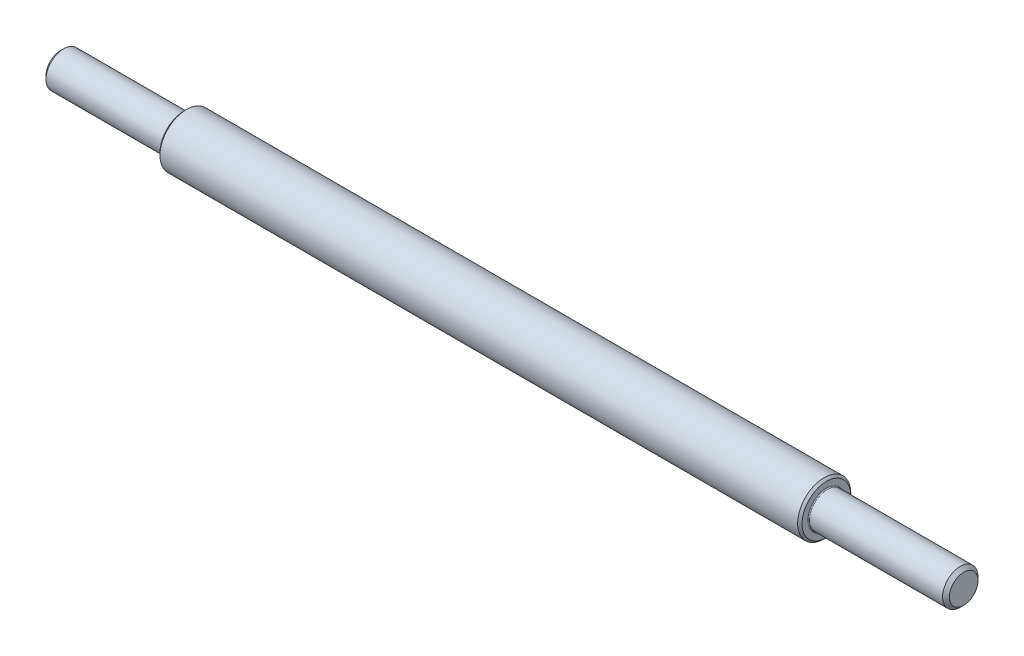
ISO-10303-21;
HEADER;
FILE_DESCRIPTION(('STEP AP214'),'2;1');
FILE_NAME('part.step','',(''),(''),'','','');
FILE_SCHEMA(('AUTOMOTIVE_DESIGN { 1 0 10303 214 1 1 1 1 }'));
ENDSEC;
DATA;
#1=APPLICATION_CONTEXT('core data for automotive mechanical design processes');
#2=APPLICATION_PROTOCOL_DEFINITION('international standard','automotive_design',2000,#1);
#3=PRODUCT_CONTEXT('',#1,'mechanical');
#4=PRODUCT('Part','Part','',(#3));
#5=PRODUCT_RELATED_PRODUCT_CATEGORY('part','',(#4));
#6=PRODUCT_DEFINITION_FORMATION('','',#4);
#7=PRODUCT_DEFINITION_CONTEXT('part definition',#1,'design');
#8=PRODUCT_DEFINITION('design','',#6,#7);
#9=PRODUCT_DEFINITION_SHAPE('','',#8);
#10=(LENGTH_UNIT() NAMED_UNIT(*) SI_UNIT(.MILLI.,.METRE.));
#11=(NAMED_UNIT(*) PLANE_ANGLE_UNIT() SI_UNIT($,.RADIAN.));
#12=(NAMED_UNIT(*) SI_UNIT($,.STERADIAN.) SOLID_ANGLE_UNIT());
#13=UNCERTAINTY_MEASURE_WITH_UNIT(LENGTH_MEASURE(1.E-05),#10,'distance_accuracy_value','');
#14=(GEOMETRIC_REPRESENTATION_CONTEXT(3) GLOBAL_UNCERTAINTY_ASSIGNED_CONTEXT((#13)) GLOBAL_UNIT_ASSIGNED_CONTEXT((#10,
#11,#12)) REPRESENTATION_CONTEXT('',''));
#15=CARTESIAN_POINT('',(0.,0.,0.));
#16=DIRECTION('',(0.,0.,1.));
#17=DIRECTION('',(1.,0.,0.));
#18=AXIS2_PLACEMENT_3D('',#15,#16,#17);
#19=CARTESIAN_POINT('',(176.,1.6165,0.));
#20=DIRECTION('',(1.,0.,0.));
#21=DIRECTION('',(0.,0.,-1.));
#22=AXIS2_PLACEMENT_3D('',#19,#20,#21);
#23=PLANE('',#22);
#24=CARTESIAN_POINT('',(175.999999999988,0.,0.));
#25=DIRECTION('',(-1.,0.,0.));
#26=DIRECTION('',(0.,0.,1.));
#27=AXIS2_PLACEMENT_3D('',#24,#25,#26);
#28=CIRCLE('',#27,3.23300000002291);
#29=CARTESIAN_POINT('',(175.999999999988,0.,3.23300000002291));
#30=VERTEX_POINT('',#29);
#31=EDGE_CURVE('E147',#30,#30,#28,.T.);
#32=ORIENTED_EDGE('',*,*,#31,.F.);
#33=EDGE_LOOP('',(#32));
#34=FACE_BOUND('',#33,.T.);
#35=ADVANCED_FACE('F16',(#34),#23,.T.);
#36=CARTESIAN_POINT('',(-28.,1.6165,0.));
#37=DIRECTION('',(-1.,0.,0.));
#38=DIRECTION('',(0.,0.,1.));
#39=AXIS2_PLACEMENT_3D('',#36,#37,#38);
#40=PLANE('',#39);
#41=CARTESIAN_POINT('',(-28.00000000002,0.,0.));
#42=DIRECTION('',(1.,0.,0.));
#43=DIRECTION('',(0.,0.,-1.));
#44=AXIS2_PLACEMENT_3D('',#41,#42,#43);
#45=CIRCLE('',#44,3.23300000007976);
#46=CARTESIAN_POINT('',(-28.00000000002,0.,-3.23300000007975));
#47=VERTEX_POINT('',#46);
#48=EDGE_CURVE('E143',#47,#47,#45,.T.);
#49=ORIENTED_EDGE('',*,*,#48,.F.);
#50=EDGE_LOOP('',(#49));
#51=FACE_BOUND('',#50,.T.);
#52=ADVANCED_FACE('F189',(#51),#40,.T.);
#53=CARTESIAN_POINT('',(175.233000000048,0.,0.));
#54=DIRECTION('',(-1.,0.,0.));
#55=DIRECTION('',(0.,0.,1.));
#56=AXIS2_PLACEMENT_3D('',#53,#54,#55);
#57=CONICAL_SURFACE('',#56,3.99999999996226,0.785398163397448);
#58=CARTESIAN_POINT('',(175.233,0.,0.));
#59=DIRECTION('',(1.,0.,0.));
#60=DIRECTION('',(0.,0.,-1.));
#61=AXIS2_PLACEMENT_3D('',#58,#59,#60);
#62=CIRCLE('',#61,4.00000000000001);
#63=CARTESIAN_POINT('',(175.233,0.,-4.00000000000001));
#64=VERTEX_POINT('',#63);
#65=EDGE_CURVE('E146',#64,#64,#62,.F.);
#66=ORIENTED_EDGE('',*,*,#65,.F.);
#67=EDGE_LOOP('',(#66));
#68=FACE_BOUND('',#67,.T.);
#69=ORIENTED_EDGE('',*,*,#31,.T.);
#70=EDGE_LOOP('',(#69));
#71=FACE_BOUND('',#70,.T.);
#72=ADVANCED_FACE('F185',(#68,#71),#57,.T.);
#73=CARTESIAN_POINT('',(-27.2330000000238,0.,0.));
#74=DIRECTION('',(1.,0.,0.));
#75=DIRECTION('',(0.,0.,-1.));
#76=AXIS2_PLACEMENT_3D('',#73,#74,#75);
#77=CONICAL_SURFACE('',#76,4.00000000007594,0.785398163397448);
#78=ORIENTED_EDGE('',*,*,#48,.T.);
#79=EDGE_LOOP('',(#78));
#80=FACE_BOUND('',#79,.T.);
#81=CARTESIAN_POINT('',(-27.233,0.,0.));
#82=DIRECTION('',(1.,0.,0.));
#83=DIRECTION('',(0.,0.,-1.));
#84=AXIS2_PLACEMENT_3D('',#81,#82,#83);
#85=CIRCLE('',#84,4.);
#86=CARTESIAN_POINT('',(-27.233,0.,-4.));
#87=VERTEX_POINT('',#86);
#88=EDGE_CURVE('E174',#87,#87,#85,.T.);
#89=ORIENTED_EDGE('',*,*,#88,.F.);
#90=EDGE_LOOP('',(#89));
#91=FACE_BOUND('',#90,.T.);
#92=ADVANCED_FACE('F188',(#80,#91),#77,.T.);
#93=CARTESIAN_POINT('',(160.2165,0.,0.));
#94=DIRECTION('',(1.,0.,0.));
#95=DIRECTION('',(0.,0.,-1.));
#96=AXIS2_PLACEMENT_3D('',#93,#94,#95);
#97=CYLINDRICAL_SURFACE('',#96,4.00000000000001);
#98=CARTESIAN_POINT('',(145.2,0.,0.));
#99=DIRECTION('',(-1.,0.,0.));
#100=DIRECTION('',(0.,0.,1.));
#101=AXIS2_PLACEMENT_3D('',#98,#99,#100);
#102=CIRCLE('',#101,4.00000000000001);
#103=CARTESIAN_POINT('',(145.2,0.,4.00000000000001));
#104=VERTEX_POINT('',#103);
#105=EDGE_CURVE('E171',#104,#104,#102,.F.);
#106=ORIENTED_EDGE('',*,*,#105,.T.);
#107=EDGE_LOOP('',(#106));
#108=FACE_BOUND('',#107,.T.);
#109=ORIENTED_EDGE('',*,*,#65,.T.);
#110=EDGE_LOOP('',(#109));
#111=FACE_BOUND('',#110,.T.);
#112=ADVANCED_FACE('F183',(#108,#111),#97,.T.);
#113=CARTESIAN_POINT('',(-13.7165,0.,0.));
#114=DIRECTION('',(1.,0.,0.));
#115=DIRECTION('',(0.,0.,-1.));
#116=AXIS2_PLACEMENT_3D('',#113,#114,#115);
#117=CYLINDRICAL_SURFACE('',#116,4.);
#118=ORIENTED_EDGE('',*,*,#88,.T.);
#119=EDGE_LOOP('',(#118));
#120=FACE_BOUND('',#119,.T.);
#121=CARTESIAN_POINT('',(-0.199999999999999,0.,0.));
#122=DIRECTION('',(-1.,0.,0.));
#123=DIRECTION('',(0.,0.,1.));
#124=AXIS2_PLACEMENT_3D('',#121,#122,#123);
#125=CIRCLE('',#124,4.);
#126=CARTESIAN_POINT('',(-0.199999999999999,0.,4.));
#127=VERTEX_POINT('',#126);
#128=EDGE_CURVE('E61',#127,#127,#125,.T.);
#129=ORIENTED_EDGE('',*,*,#128,.T.);
#130=EDGE_LOOP('',(#129));
#131=FACE_BOUND('',#130,.T.);
#132=ADVANCED_FACE('F240',(#120,#131),#117,.T.);
#133=CARTESIAN_POINT('',(145.2,0.,0.));
#134=DIRECTION('',(-1.,0.,0.));
#135=DIRECTION('',(0.,0.,1.));
#136=AXIS2_PLACEMENT_3D('',#133,#134,#135);
#137=TOROIDAL_SURFACE('',#136,4.19999999999997,0.19999999999996);
#138=CARTESIAN_POINT('',(145.,0.,0.));
#139=DIRECTION('',(1.,0.,0.));
#140=DIRECTION('',(0.,1.,0.));
#141=AXIS2_PLACEMENT_3D('',#138,#139,#140);
#142=CIRCLE('',#141,4.19999999999999);
#143=CARTESIAN_POINT('',(145.,0.,4.19999999999999));
#144=VERTEX_POINT('',#143);
#145=CARTESIAN_POINT('',(145.,4.2,0.));
#146=VERTEX_POINT('',#145);
#147=EDGE_CURVE('E57',#144,#146,#142,.F.);
#148=ORIENTED_EDGE('',*,*,#147,.F.);
#149=CARTESIAN_POINT('',(145.,0.,0.));
#150=DIRECTION('',(1.,0.,0.));
#151=DIRECTION('',(0.,0.,1.));
#152=AXIS2_PLACEMENT_3D('',#149,#150,#151);
#153=CIRCLE('',#152,4.19999999999999);
#154=CARTESIAN_POINT('',(145.,0.,-4.19999999999999));
#155=VERTEX_POINT('',#154);
#156=EDGE_CURVE('E50',#155,#144,#153,.F.);
#157=ORIENTED_EDGE('',*,*,#156,.F.);
#158=CARTESIAN_POINT('',(145.,0.,0.));
#159=DIRECTION('',(1.,0.,0.));
#160=DIRECTION('',(0.,0.,-1.));
#161=AXIS2_PLACEMENT_3D('',#158,#159,#160);
#162=CIRCLE('',#161,4.2);
#163=EDGE_CURVE('E52',#146,#155,#162,.F.);
#164=ORIENTED_EDGE('',*,*,#163,.F.);
#165=EDGE_LOOP('',(#148,#157,#164));
#166=FACE_BOUND('',#165,.T.);
#167=ORIENTED_EDGE('',*,*,#105,.F.);
#168=EDGE_LOOP('',(#167));
#169=FACE_BOUND('',#168,.T.);
#170=ADVANCED_FACE('F55',(#166,#169),#137,.F.);
#171=CARTESIAN_POINT('',(-0.2,0.,0.));
#172=DIRECTION('',(-1.,0.,0.));
#173=DIRECTION('',(0.,0.,1.));
#174=AXIS2_PLACEMENT_3D('',#171,#172,#173);
#175=TOROIDAL_SURFACE('',#174,4.2,0.2);
#176=CARTESIAN_POINT('',(0.,0.,0.));
#177=DIRECTION('',(-1.,0.,0.));
#178=DIRECTION('',(0.,0.,-1.));
#179=AXIS2_PLACEMENT_3D('',#176,#177,#178);
#180=CIRCLE('',#179,4.2);
#181=CARTESIAN_POINT('',(0.,0.,4.2));
#182=VERTEX_POINT('',#181);
#183=CARTESIAN_POINT('',(0.,0.,-4.2));
#184=VERTEX_POINT('',#183);
#185=EDGE_CURVE('E36',#182,#184,#180,.F.);
#186=ORIENTED_EDGE('',*,*,#185,.F.);
#187=CARTESIAN_POINT('',(0.,0.,0.));
#188=DIRECTION('',(-1.,0.,0.));
#189=DIRECTION('',(0.,0.,1.));
#190=AXIS2_PLACEMENT_3D('',#187,#188,#189);
#191=CIRCLE('',#190,4.2);
#192=CARTESIAN_POINT('',(0.,4.2,0.));
#193=VERTEX_POINT('',#192);
#194=EDGE_CURVE('E123',#193,#182,#191,.F.);
#195=ORIENTED_EDGE('',*,*,#194,.F.);
#196=CARTESIAN_POINT('',(0.,0.,0.));
#197=DIRECTION('',(-1.,0.,0.));
#198=DIRECTION('',(0.,1.,0.));
#199=AXIS2_PLACEMENT_3D('',#196,#197,#198);
#200=CIRCLE('',#199,4.2);
#201=EDGE_CURVE('E68',#184,#193,#200,.F.);
#202=ORIENTED_EDGE('',*,*,#201,.F.);
#203=EDGE_LOOP('',(#186,#195,#202));
#204=FACE_BOUND('',#203,.T.);
#205=ORIENTED_EDGE('',*,*,#128,.F.);
#206=EDGE_LOOP('',(#205));
#207=FACE_BOUND('',#206,.T.);
#208=ADVANCED_FACE('F88',(#204,#207),#175,.F.);
#209=CARTESIAN_POINT('',(145.,4.85,0.));
#210=DIRECTION('',(1.,0.,0.));
#211=DIRECTION('',(0.,0.,-1.));
#212=AXIS2_PLACEMENT_3D('',#209,#210,#211);
#213=PLANE('',#212);
#214=ORIENTED_EDGE('',*,*,#156,.T.);
#215=ORIENTED_EDGE('',*,*,#147,.T.);
#216=ORIENTED_EDGE('',*,*,#163,.T.);
#217=EDGE_LOOP('',(#214,#215,#216));
#218=FACE_BOUND('',#217,.T.);
#219=CARTESIAN_POINT('',(144.999999999982,0.,0.));
#220=DIRECTION('',(-1.,0.,0.));
#221=DIRECTION('',(0.,0.,1.));
#222=AXIS2_PLACEMENT_3D('',#219,#220,#221);
#223=CIRCLE('',#222,5.49999999992679);
#224=CARTESIAN_POINT('',(144.999999999982,0.,5.49999999992679));
#225=VERTEX_POINT('',#224);
#226=EDGE_CURVE('E133',#225,#225,#223,.T.);
#227=ORIENTED_EDGE('',*,*,#226,.F.);
#228=EDGE_LOOP('',(#227));
#229=FACE_BOUND('',#228,.T.);
#230=ADVANCED_FACE('F65',(#218,#229),#213,.T.);
#231=CARTESIAN_POINT('',(0.,4.85,0.));
#232=DIRECTION('',(-1.,0.,0.));
#233=DIRECTION('',(0.,-1.,0.));
#234=AXIS2_PLACEMENT_3D('',#231,#232,#233);
#235=PLANE('',#234);
#236=CARTESIAN_POINT('',(5.6843418860808E-11,0.,0.));
#237=DIRECTION('',(1.,0.,0.));
#238=DIRECTION('',(0.,0.,-1.));
#239=AXIS2_PLACEMENT_3D('',#236,#237,#238);
#240=CIRCLE('',#239,5.50000000004047);
#241=CARTESIAN_POINT('',(5.6843418860808E-11,0.,-5.50000000004047));
#242=VERTEX_POINT('',#241);
#243=EDGE_CURVE('E135',#242,#242,#240,.T.);
#244=ORIENTED_EDGE('',*,*,#243,.F.);
#245=EDGE_LOOP('',(#244));
#246=FACE_BOUND('',#245,.T.);
#247=ORIENTED_EDGE('',*,*,#194,.T.);
#248=ORIENTED_EDGE('',*,*,#185,.T.);
#249=ORIENTED_EDGE('',*,*,#201,.T.);
#250=EDGE_LOOP('',(#247,#248,#249));
#251=FACE_BOUND('',#250,.T.);
#252=ADVANCED_FACE('F87',(#246,#251),#235,.T.);
#253=CARTESIAN_POINT('',(144.499999999994,0.,0.));
#254=DIRECTION('',(-1.,0.,0.));
#255=DIRECTION('',(0.,0.,1.));
#256=AXIS2_PLACEMENT_3D('',#253,#254,#255);
#257=CONICAL_SURFACE('',#256,5.99999999991496,0.785398163397448);
#258=ORIENTED_EDGE('',*,*,#226,.T.);
#259=EDGE_LOOP('',(#258));
#260=FACE_BOUND('',#259,.T.);
#261=CARTESIAN_POINT('',(144.5,0.,0.));
#262=DIRECTION('',(1.,0.,0.));
#263=DIRECTION('',(0.,0.,-1.));
#264=AXIS2_PLACEMENT_3D('',#261,#262,#263);
#265=CIRCLE('',#264,6.);
#266=CARTESIAN_POINT('',(144.5,0.,-6.));
#267=VERTEX_POINT('',#266);
#268=EDGE_CURVE('E27',#267,#267,#265,.F.);
#269=ORIENTED_EDGE('',*,*,#268,.F.);
#270=EDGE_LOOP('',(#269));
#271=FACE_BOUND('',#270,.T.);
#272=ADVANCED_FACE('F207',(#260,#271),#257,.T.);
#273=CARTESIAN_POINT('',(0.499999999988177,0.,0.));
#274=DIRECTION('',(1.,0.,0.));
#275=DIRECTION('',(0.,0.,-1.));
#276=AXIS2_PLACEMENT_3D('',#273,#274,#275);
#277=CONICAL_SURFACE('',#276,5.99999999991496,0.785398163340605);
#278=ORIENTED_EDGE('',*,*,#243,.T.);
#279=EDGE_LOOP('',(#278));
#280=FACE_BOUND('',#279,.T.);
#281=CARTESIAN_POINT('',(0.5,0.,0.));
#282=DIRECTION('',(1.,0.,0.));
#283=DIRECTION('',(0.,0.,-1.));
#284=AXIS2_PLACEMENT_3D('',#281,#282,#283);
#285=CIRCLE('',#284,6.);
#286=CARTESIAN_POINT('',(0.5,0.,-6.));
#287=VERTEX_POINT('',#286);
#288=EDGE_CURVE('E10',#287,#287,#285,.T.);
#289=ORIENTED_EDGE('',*,*,#288,.F.);
#290=EDGE_LOOP('',(#289));
#291=FACE_BOUND('',#290,.T.);
#292=ADVANCED_FACE('F201',(#280,#291),#277,.T.);
#293=CARTESIAN_POINT('',(72.5,0.,0.));
#294=DIRECTION('',(1.,0.,0.));
#295=DIRECTION('',(0.,0.,-1.));
#296=AXIS2_PLACEMENT_3D('',#293,#294,#295);
#297=CYLINDRICAL_SURFACE('',#296,6.);
#298=ORIENTED_EDGE('',*,*,#268,.T.);
#299=EDGE_LOOP('',(#298));
#300=FACE_BOUND('',#299,.T.);
#301=ORIENTED_EDGE('',*,*,#288,.T.);
#302=EDGE_LOOP('',(#301));
#303=FACE_BOUND('',#302,.T.);
#304=ADVANCED_FACE('F199',(#300,#303),#297,.T.);
#305=CLOSED_SHELL('',(#35,#52,#72,#92,#112,#132,#170,#208,#230,#252,#272,#292,#304));
#306=MANIFOLD_SOLID_BREP('B1',#305);
#307=ADVANCED_BREP_SHAPE_REPRESENTATION('',(#18,#306),#14);
#308=SHAPE_DEFINITION_REPRESENTATION(#9,#307);
ENDSEC;
END-ISO-10303-21;
